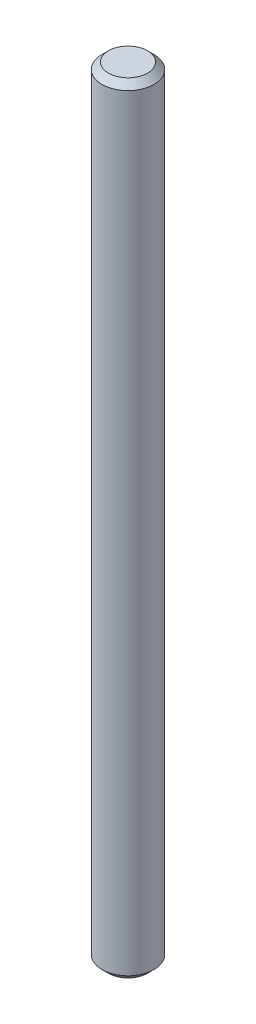
ISO-10303-21;
HEADER;
FILE_DESCRIPTION(('STEP AP214'),'2;1');
FILE_NAME('part.step','',(''),(''),'','','');
FILE_SCHEMA(('AUTOMOTIVE_DESIGN { 1 0 10303 214 1 1 1 1 }'));
ENDSEC;
DATA;
#1=APPLICATION_CONTEXT('core data for automotive mechanical design processes');
#2=APPLICATION_PROTOCOL_DEFINITION('international standard','automotive_design',2000,#1);
#3=PRODUCT_CONTEXT('',#1,'mechanical');
#4=PRODUCT('Part','Part','',(#3));
#5=PRODUCT_RELATED_PRODUCT_CATEGORY('part','',(#4));
#6=PRODUCT_DEFINITION_FORMATION('','',#4);
#7=PRODUCT_DEFINITION_CONTEXT('part definition',#1,'design');
#8=PRODUCT_DEFINITION('design','',#6,#7);
#9=PRODUCT_DEFINITION_SHAPE('','',#8);
#10=(LENGTH_UNIT() NAMED_UNIT(*) SI_UNIT(.MILLI.,.METRE.));
#11=(NAMED_UNIT(*) PLANE_ANGLE_UNIT() SI_UNIT($,.RADIAN.));
#12=(NAMED_UNIT(*) SI_UNIT($,.STERADIAN.) SOLID_ANGLE_UNIT());
#13=UNCERTAINTY_MEASURE_WITH_UNIT(LENGTH_MEASURE(1.E-05),#10,'distance_accuracy_value','');
#14=(GEOMETRIC_REPRESENTATION_CONTEXT(3) GLOBAL_UNCERTAINTY_ASSIGNED_CONTEXT((#13)) GLOBAL_UNIT_ASSIGNED_CONTEXT((#10,
#11,#12)) REPRESENTATION_CONTEXT('',''));
#15=CARTESIAN_POINT('',(0.,0.,0.));
#16=DIRECTION('',(0.,0.,1.));
#17=DIRECTION('',(1.,0.,0.));
#18=AXIS2_PLACEMENT_3D('',#15,#16,#17);
#19=CARTESIAN_POINT('',(0.,120.,0.));
#20=DIRECTION('',(0.,-1.,0.));
#21=DIRECTION('',(0.,0.,-1.));
#22=AXIS2_PLACEMENT_3D('',#19,#20,#21);
#23=CYLINDRICAL_SURFACE('',#22,4.);
#24=CARTESIAN_POINT('',(0.,1.,0.));
#25=DIRECTION('',(0.,1.,0.));
#26=DIRECTION('',(0.,0.,1.));
#27=AXIS2_PLACEMENT_3D('',#24,#25,#26);
#28=CIRCLE('',#27,4.);
#29=CARTESIAN_POINT('',(0.,1.,4.));
#30=VERTEX_POINT('',#29);
#31=EDGE_CURVE('E42',#30,#30,#28,.T.);
#32=ORIENTED_EDGE('',*,*,#31,.T.);
#33=EDGE_LOOP('',(#32));
#34=FACE_BOUND('',#33,.T.);
#35=CARTESIAN_POINT('',(0.,119.,0.));
#36=DIRECTION('',(0.,1.,0.));
#37=DIRECTION('',(0.,0.,1.));
#38=AXIS2_PLACEMENT_3D('',#35,#36,#37);
#39=CIRCLE('',#38,4.);
#40=CARTESIAN_POINT('',(0.,119.,4.));
#41=VERTEX_POINT('',#40);
#42=EDGE_CURVE('E46',#41,#41,#39,.F.);
#43=ORIENTED_EDGE('',*,*,#42,.T.);
#44=EDGE_LOOP('',(#43));
#45=FACE_BOUND('',#44,.T.);
#46=ADVANCED_FACE('F31',(#34,#45),#23,.T.);
#47=CARTESIAN_POINT('',(0.,120.,0.));
#48=DIRECTION('',(0.,1.,0.));
#49=DIRECTION('',(0.,0.,1.));
#50=AXIS2_PLACEMENT_3D('',#47,#48,#49);
#51=PLANE('',#50);
#52=CARTESIAN_POINT('',(0.,120.,0.));
#53=DIRECTION('',(0.,1.,0.));
#54=DIRECTION('',(0.,0.,1.));
#55=AXIS2_PLACEMENT_3D('',#52,#53,#54);
#56=CIRCLE('',#55,3.00000000000002);
#57=CARTESIAN_POINT('',(0.,120.,3.00000000000002));
#58=VERTEX_POINT('',#57);
#59=EDGE_CURVE('E10',#58,#58,#56,.T.);
#60=ORIENTED_EDGE('',*,*,#59,.T.);
#61=EDGE_LOOP('',(#60));
#62=FACE_BOUND('',#61,.T.);
#63=ADVANCED_FACE('F62',(#62),#51,.T.);
#64=CARTESIAN_POINT('',(0.,0.,0.));
#65=DIRECTION('',(0.,1.,0.));
#66=DIRECTION('',(0.,0.,1.));
#67=AXIS2_PLACEMENT_3D('',#64,#65,#66);
#68=PLANE('',#67);
#69=CARTESIAN_POINT('',(0.,0.,0.));
#70=DIRECTION('',(0.,1.,0.));
#71=DIRECTION('',(0.,0.,1.));
#72=AXIS2_PLACEMENT_3D('',#69,#70,#71);
#73=CIRCLE('',#72,3.);
#74=CARTESIAN_POINT('',(0.,0.,3.));
#75=VERTEX_POINT('',#74);
#76=EDGE_CURVE('E38',#75,#75,#73,.F.);
#77=ORIENTED_EDGE('',*,*,#76,.T.);
#78=EDGE_LOOP('',(#77));
#79=FACE_BOUND('',#78,.T.);
#80=ADVANCED_FACE('F59',(#79),#68,.F.);
#81=CARTESIAN_POINT('',(0.,1.,0.));
#82=DIRECTION('',(0.,1.,0.));
#83=DIRECTION('',(0.,0.,1.));
#84=AXIS2_PLACEMENT_3D('',#81,#82,#83);
#85=CONICAL_SURFACE('',#84,4.,0.785398163397447);
#86=ORIENTED_EDGE('',*,*,#76,.F.);
#87=EDGE_LOOP('',(#86));
#88=FACE_BOUND('',#87,.T.);
#89=ORIENTED_EDGE('',*,*,#31,.F.);
#90=EDGE_LOOP('',(#89));
#91=FACE_BOUND('',#90,.T.);
#92=ADVANCED_FACE('F55',(#88,#91),#85,.T.);
#93=CARTESIAN_POINT('',(0.,120.,0.));
#94=DIRECTION('',(0.,-1.,0.));
#95=DIRECTION('',(0.,0.,-1.));
#96=AXIS2_PLACEMENT_3D('',#93,#94,#95);
#97=CONICAL_SURFACE('',#96,3.00000000000002,0.785398163397447);
#98=ORIENTED_EDGE('',*,*,#42,.F.);
#99=EDGE_LOOP('',(#98));
#100=FACE_BOUND('',#99,.T.);
#101=ORIENTED_EDGE('',*,*,#59,.F.);
#102=EDGE_LOOP('',(#101));
#103=FACE_BOUND('',#102,.T.);
#104=ADVANCED_FACE('F33',(#100,#103),#97,.T.);
#105=CLOSED_SHELL('',(#46,#63,#80,#92,#104));
#106=MANIFOLD_SOLID_BREP('B2',#105);
#107=ADVANCED_BREP_SHAPE_REPRESENTATION('',(#18,#106),#14);
#108=SHAPE_DEFINITION_REPRESENTATION(#9,#107);
ENDSEC;
END-ISO-10303-21;
